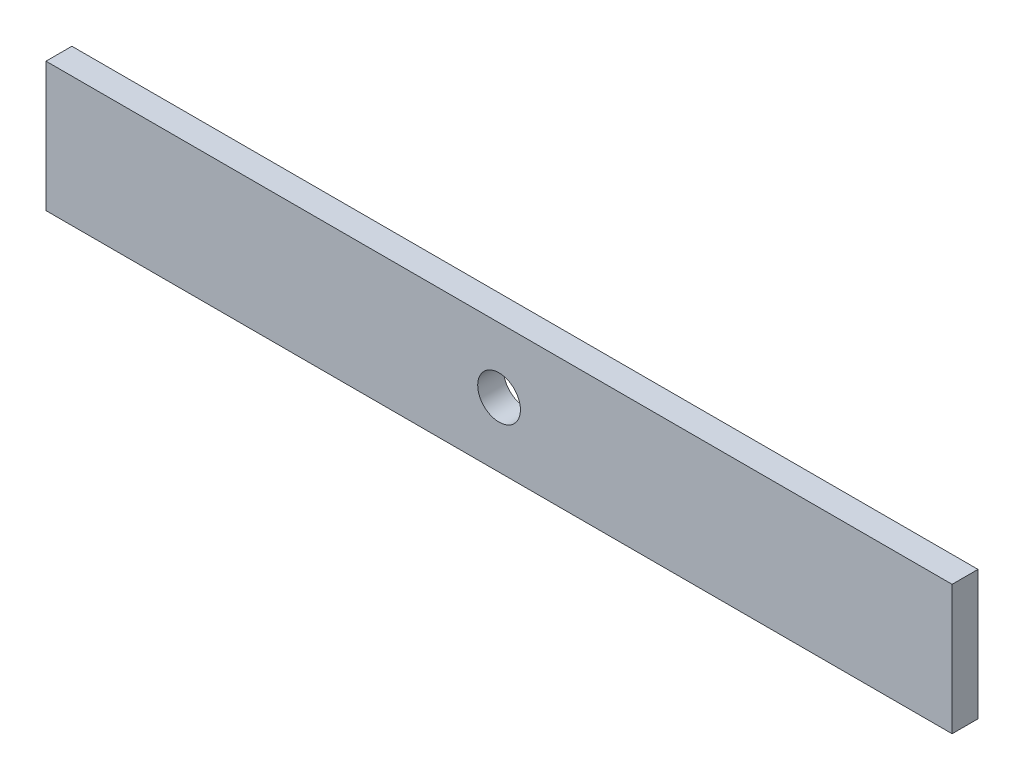
ISO-10303-21;
HEADER;
FILE_DESCRIPTION(('STEP AP214'),'2;1');
FILE_NAME('part.step','',(''),(''),'','','');
FILE_SCHEMA(('AUTOMOTIVE_DESIGN { 1 0 10303 214 1 1 1 1 }'));
ENDSEC;
DATA;
#1=APPLICATION_CONTEXT('core data for automotive mechanical design processes');
#2=APPLICATION_PROTOCOL_DEFINITION('international standard','automotive_design',2000,#1);
#3=PRODUCT_CONTEXT('',#1,'mechanical');
#4=PRODUCT('Part','Part','',(#3));
#5=PRODUCT_RELATED_PRODUCT_CATEGORY('part','',(#4));
#6=PRODUCT_DEFINITION_FORMATION('','',#4);
#7=PRODUCT_DEFINITION_CONTEXT('part definition',#1,'design');
#8=PRODUCT_DEFINITION('design','',#6,#7);
#9=PRODUCT_DEFINITION_SHAPE('','',#8);
#10=(LENGTH_UNIT() NAMED_UNIT(*) SI_UNIT(.MILLI.,.METRE.));
#11=(NAMED_UNIT(*) PLANE_ANGLE_UNIT() SI_UNIT($,.RADIAN.));
#12=(NAMED_UNIT(*) SI_UNIT($,.STERADIAN.) SOLID_ANGLE_UNIT());
#13=UNCERTAINTY_MEASURE_WITH_UNIT(LENGTH_MEASURE(1.E-05),#10,'distance_accuracy_value','');
#14=(GEOMETRIC_REPRESENTATION_CONTEXT(3) GLOBAL_UNCERTAINTY_ASSIGNED_CONTEXT((#13)) GLOBAL_UNIT_ASSIGNED_CONTEXT((#10,
#11,#12)) REPRESENTATION_CONTEXT('',''));
#15=CARTESIAN_POINT('',(0.,0.,0.));
#16=DIRECTION('',(0.,0.,1.));
#17=DIRECTION('',(1.,0.,0.));
#18=AXIS2_PLACEMENT_3D('',#15,#16,#17);
#19=CARTESIAN_POINT('',(35.,5.,-2.));
#20=DIRECTION('',(1.,0.,0.));
#21=DIRECTION('',(0.,0.,-1.));
#22=AXIS2_PLACEMENT_3D('',#19,#20,#21);
#23=PLANE('',#22);
#24=DIRECTION('',(0.,1.,0.));
#25=VECTOR('',#24,1.);
#26=CARTESIAN_POINT('',(35.,5.,0.));
#27=LINE('',#26,#25);
#28=CARTESIAN_POINT('',(35.,-5.,0.));
#29=VERTEX_POINT('',#28);
#30=CARTESIAN_POINT('',(35.,5.,0.));
#31=VERTEX_POINT('',#30);
#32=EDGE_CURVE('E106',#29,#31,#27,.T.);
#33=ORIENTED_EDGE('',*,*,#32,.F.);
#34=DIRECTION('',(0.,0.,1.));
#35=VECTOR('',#34,1.);
#36=CARTESIAN_POINT('',(35.,-5.,-2.));
#37=LINE('',#36,#35);
#38=CARTESIAN_POINT('',(35.,-5.,-2.));
#39=VERTEX_POINT('',#38);
#40=EDGE_CURVE('E11',#39,#29,#37,.T.);
#41=ORIENTED_EDGE('',*,*,#40,.F.);
#42=DIRECTION('',(0.,1.,0.));
#43=VECTOR('',#42,1.);
#44=CARTESIAN_POINT('',(35.,5.,-2.));
#45=LINE('',#44,#43);
#46=CARTESIAN_POINT('',(35.,5.,-2.));
#47=VERTEX_POINT('',#46);
#48=EDGE_CURVE('E99',#39,#47,#45,.T.);
#49=ORIENTED_EDGE('',*,*,#48,.T.);
#50=DIRECTION('',(0.,0.,1.));
#51=VECTOR('',#50,1.);
#52=CARTESIAN_POINT('',(35.,5.,-2.));
#53=LINE('',#52,#51);
#54=EDGE_CURVE('E44',#47,#31,#53,.T.);
#55=ORIENTED_EDGE('',*,*,#54,.T.);
#56=EDGE_LOOP('',(#33,#41,#49,#55));
#57=FACE_BOUND('',#56,.T.);
#58=ADVANCED_FACE('F41',(#57),#23,.T.);
#59=CARTESIAN_POINT('',(-35.,-5.,-2.));
#60=DIRECTION('',(0.,-1.,0.));
#61=DIRECTION('',(0.,0.,-1.));
#62=AXIS2_PLACEMENT_3D('',#59,#60,#61);
#63=PLANE('',#62);
#64=DIRECTION('',(1.,0.,0.));
#65=VECTOR('',#64,1.);
#66=CARTESIAN_POINT('',(-35.,-5.,0.));
#67=LINE('',#66,#65);
#68=CARTESIAN_POINT('',(-35.,-5.,0.));
#69=VERTEX_POINT('',#68);
#70=EDGE_CURVE('E101',#69,#29,#67,.T.);
#71=ORIENTED_EDGE('',*,*,#70,.F.);
#72=DIRECTION('',(0.,0.,1.));
#73=VECTOR('',#72,1.);
#74=CARTESIAN_POINT('',(-35.,-5.,-2.));
#75=LINE('',#74,#73);
#76=CARTESIAN_POINT('',(-35.,-5.,-2.));
#77=VERTEX_POINT('',#76);
#78=EDGE_CURVE('E50',#77,#69,#75,.T.);
#79=ORIENTED_EDGE('',*,*,#78,.F.);
#80=DIRECTION('',(1.,0.,0.));
#81=VECTOR('',#80,1.);
#82=CARTESIAN_POINT('',(-35.,-5.,-2.));
#83=LINE('',#82,#81);
#84=EDGE_CURVE('E96',#77,#39,#83,.T.);
#85=ORIENTED_EDGE('',*,*,#84,.T.);
#86=ORIENTED_EDGE('',*,*,#40,.T.);
#87=EDGE_LOOP('',(#71,#79,#85,#86));
#88=FACE_BOUND('',#87,.T.);
#89=ADVANCED_FACE('F117',(#88),#63,.T.);
#90=CARTESIAN_POINT('',(-35.,5.,-2.));
#91=DIRECTION('',(-1.,0.,0.));
#92=DIRECTION('',(0.,0.,1.));
#93=AXIS2_PLACEMENT_3D('',#90,#91,#92);
#94=PLANE('',#93);
#95=DIRECTION('',(0.,-1.,0.));
#96=VECTOR('',#95,1.);
#97=CARTESIAN_POINT('',(-35.,5.,0.));
#98=LINE('',#97,#96);
#99=CARTESIAN_POINT('',(-35.,5.,0.));
#100=VERTEX_POINT('',#99);
#101=EDGE_CURVE('E91',#100,#69,#98,.T.);
#102=ORIENTED_EDGE('',*,*,#101,.F.);
#103=DIRECTION('',(0.,0.,1.));
#104=VECTOR('',#103,1.);
#105=CARTESIAN_POINT('',(-35.,5.,-2.));
#106=LINE('',#105,#104);
#107=CARTESIAN_POINT('',(-35.,5.,-2.));
#108=VERTEX_POINT('',#107);
#109=EDGE_CURVE('E86',#108,#100,#106,.T.);
#110=ORIENTED_EDGE('',*,*,#109,.F.);
#111=DIRECTION('',(0.,-1.,0.));
#112=VECTOR('',#111,1.);
#113=CARTESIAN_POINT('',(-35.,5.,-2.));
#114=LINE('',#113,#112);
#115=EDGE_CURVE('E89',#108,#77,#114,.T.);
#116=ORIENTED_EDGE('',*,*,#115,.T.);
#117=ORIENTED_EDGE('',*,*,#78,.T.);
#118=EDGE_LOOP('',(#102,#110,#116,#117));
#119=FACE_BOUND('',#118,.T.);
#120=ADVANCED_FACE('F88',(#119),#94,.T.);
#121=CARTESIAN_POINT('',(-35.,5.,-2.));
#122=DIRECTION('',(0.,1.,0.));
#123=DIRECTION('',(0.,0.,1.));
#124=AXIS2_PLACEMENT_3D('',#121,#122,#123);
#125=PLANE('',#124);
#126=DIRECTION('',(-1.,0.,0.));
#127=VECTOR('',#126,1.);
#128=CARTESIAN_POINT('',(-35.,5.,0.));
#129=LINE('',#128,#127);
#130=EDGE_CURVE('E109',#31,#100,#129,.T.);
#131=ORIENTED_EDGE('',*,*,#130,.F.);
#132=ORIENTED_EDGE('',*,*,#54,.F.);
#133=DIRECTION('',(-1.,0.,0.));
#134=VECTOR('',#133,1.);
#135=CARTESIAN_POINT('',(-35.,5.,-2.));
#136=LINE('',#135,#134);
#137=EDGE_CURVE('E95',#47,#108,#136,.T.);
#138=ORIENTED_EDGE('',*,*,#137,.T.);
#139=ORIENTED_EDGE('',*,*,#109,.T.);
#140=EDGE_LOOP('',(#131,#132,#138,#139));
#141=FACE_BOUND('',#140,.T.);
#142=ADVANCED_FACE('F98',(#141),#125,.T.);
#143=CARTESIAN_POINT('',(0.,0.,-2.));
#144=DIRECTION('',(0.,0.,1.));
#145=DIRECTION('',(1.,0.,0.));
#146=AXIS2_PLACEMENT_3D('',#143,#144,#145);
#147=PLANE('',#146);
#148=CARTESIAN_POINT('',(0.,0.,-2.));
#149=DIRECTION('',(0.,0.,-1.));
#150=DIRECTION('',(-1.,0.,0.));
#151=AXIS2_PLACEMENT_3D('',#148,#149,#150);
#152=CIRCLE('',#151,1.65);
#153=CARTESIAN_POINT('',(-1.65,0.,-2.));
#154=VERTEX_POINT('',#153);
#155=EDGE_CURVE('E147',#154,#154,#152,.T.);
#156=ORIENTED_EDGE('',*,*,#155,.F.);
#157=EDGE_LOOP('',(#156));
#158=FACE_BOUND('',#157,.T.);
#159=ORIENTED_EDGE('',*,*,#48,.F.);
#160=ORIENTED_EDGE('',*,*,#84,.F.);
#161=ORIENTED_EDGE('',*,*,#115,.F.);
#162=ORIENTED_EDGE('',*,*,#137,.F.);
#163=EDGE_LOOP('',(#159,#160,#161,#162));
#164=FACE_BOUND('',#163,.T.);
#165=ADVANCED_FACE('F94',(#158,#164),#147,.F.);
#166=CARTESIAN_POINT('',(0.,0.,0.));
#167=DIRECTION('',(0.,0.,1.));
#168=DIRECTION('',(1.,0.,0.));
#169=AXIS2_PLACEMENT_3D('',#166,#167,#168);
#170=PLANE('',#169);
#171=CARTESIAN_POINT('',(0.,0.,0.));
#172=DIRECTION('',(0.,0.,1.));
#173=DIRECTION('',(1.,0.,0.));
#174=AXIS2_PLACEMENT_3D('',#171,#172,#173);
#175=CIRCLE('',#174,1.65);
#176=CARTESIAN_POINT('',(1.65,0.,0.));
#177=VERTEX_POINT('',#176);
#178=EDGE_CURVE('E110',#177,#177,#175,.T.);
#179=ORIENTED_EDGE('',*,*,#178,.F.);
#180=EDGE_LOOP('',(#179));
#181=FACE_BOUND('',#180,.T.);
#182=ORIENTED_EDGE('',*,*,#32,.T.);
#183=ORIENTED_EDGE('',*,*,#130,.T.);
#184=ORIENTED_EDGE('',*,*,#101,.T.);
#185=ORIENTED_EDGE('',*,*,#70,.T.);
#186=EDGE_LOOP('',(#182,#183,#184,#185));
#187=FACE_BOUND('',#186,.T.);
#188=ADVANCED_FACE('F116',(#181,#187),#170,.T.);
#189=CARTESIAN_POINT('',(0.,0.,-2.));
#190=DIRECTION('',(0.,0.,-1.));
#191=DIRECTION('',(-1.,0.,0.));
#192=AXIS2_PLACEMENT_3D('',#189,#190,#191);
#193=CYLINDRICAL_SURFACE('',#192,1.65);
#194=ORIENTED_EDGE('',*,*,#178,.T.);
#195=EDGE_LOOP('',(#194));
#196=FACE_BOUND('',#195,.T.);
#197=ORIENTED_EDGE('',*,*,#155,.T.);
#198=EDGE_LOOP('',(#197));
#199=FACE_BOUND('',#198,.T.);
#200=ADVANCED_FACE('F135',(#196,#199),#193,.F.);
#201=CLOSED_SHELL('',(#58,#89,#120,#142,#165,#188,#200));
#202=MANIFOLD_SOLID_BREP('B2',#201);
#203=ADVANCED_BREP_SHAPE_REPRESENTATION('',(#18,#202),#14);
#204=SHAPE_DEFINITION_REPRESENTATION(#9,#203);
ENDSEC;
END-ISO-10303-21;
